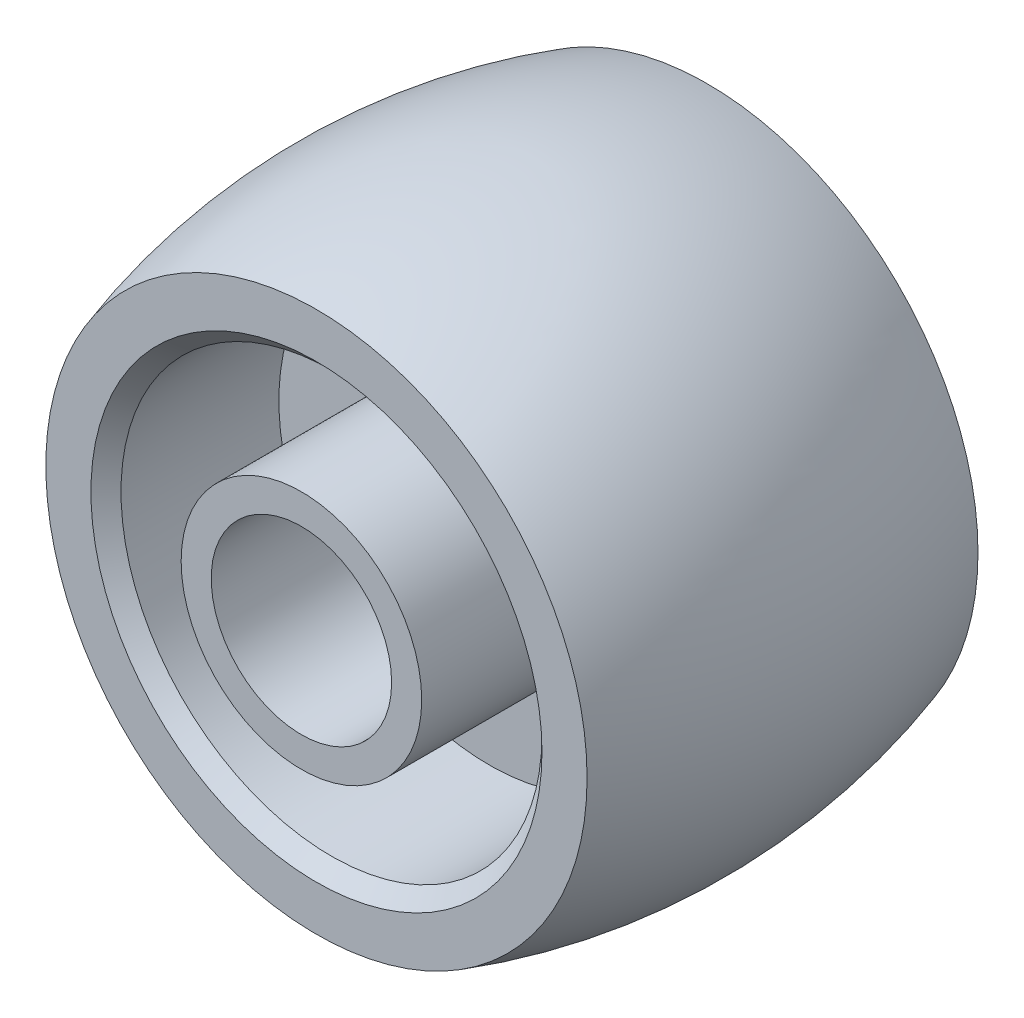
ISO-10303-21;
HEADER;
FILE_DESCRIPTION(('STEP AP214'),'2;1');
FILE_NAME('part.step','',(''),(''),'','','');
FILE_SCHEMA(('AUTOMOTIVE_DESIGN { 1 0 10303 214 1 1 1 1 }'));
ENDSEC;
DATA;
#1=APPLICATION_CONTEXT('core data for automotive mechanical design processes');
#2=APPLICATION_PROTOCOL_DEFINITION('international standard','automotive_design',2000,#1);
#3=PRODUCT_CONTEXT('',#1,'mechanical');
#4=PRODUCT('Part','Part','',(#3));
#5=PRODUCT_RELATED_PRODUCT_CATEGORY('part','',(#4));
#6=PRODUCT_DEFINITION_FORMATION('','',#4);
#7=PRODUCT_DEFINITION_CONTEXT('part definition',#1,'design');
#8=PRODUCT_DEFINITION('design','',#6,#7);
#9=PRODUCT_DEFINITION_SHAPE('','',#8);
#10=(LENGTH_UNIT() NAMED_UNIT(*) SI_UNIT(.MILLI.,.METRE.));
#11=(NAMED_UNIT(*) PLANE_ANGLE_UNIT() SI_UNIT($,.RADIAN.));
#12=(NAMED_UNIT(*) SI_UNIT($,.STERADIAN.) SOLID_ANGLE_UNIT());
#13=UNCERTAINTY_MEASURE_WITH_UNIT(LENGTH_MEASURE(1.E-05),#10,'distance_accuracy_value','');
#14=(GEOMETRIC_REPRESENTATION_CONTEXT(3) GLOBAL_UNCERTAINTY_ASSIGNED_CONTEXT((#13)) GLOBAL_UNIT_ASSIGNED_CONTEXT((#10,
#11,#12)) REPRESENTATION_CONTEXT('',''));
#15=CARTESIAN_POINT('',(0.,0.,0.));
#16=DIRECTION('',(0.,0.,1.));
#17=DIRECTION('',(1.,0.,0.));
#18=AXIS2_PLACEMENT_3D('',#15,#16,#17);
#19=CARTESIAN_POINT('',(0.,0.,6.5));
#20=DIRECTION('',(0.,0.,1.));
#21=DIRECTION('',(1.,0.,0.));
#22=AXIS2_PLACEMENT_3D('',#19,#20,#21);
#23=CONICAL_SURFACE('',#22,7.5,0.785398163397449);
#24=CARTESIAN_POINT('',(0.,0.,6.));
#25=DIRECTION('',(0.,0.,1.));
#26=DIRECTION('',(1.,0.,0.));
#27=AXIS2_PLACEMENT_3D('',#24,#25,#26);
#28=CIRCLE('',#27,7.);
#29=CARTESIAN_POINT('',(7.,0.,6.));
#30=VERTEX_POINT('',#29);
#31=EDGE_CURVE('E10',#30,#30,#28,.T.);
#32=ORIENTED_EDGE('',*,*,#31,.F.);
#33=EDGE_LOOP('',(#32));
#34=FACE_BOUND('',#33,.T.);
#35=CARTESIAN_POINT('',(0.,0.,6.5));
#36=DIRECTION('',(0.,0.,1.));
#37=DIRECTION('',(1.,0.,0.));
#38=AXIS2_PLACEMENT_3D('',#35,#36,#37);
#39=CIRCLE('',#38,7.5);
#40=CARTESIAN_POINT('',(7.5,0.,6.5));
#41=VERTEX_POINT('',#40);
#42=EDGE_CURVE('E76',#41,#41,#39,.T.);
#43=ORIENTED_EDGE('',*,*,#42,.T.);
#44=EDGE_LOOP('',(#43));
#45=FACE_BOUND('',#44,.T.);
#46=ADVANCED_FACE('F30',(#34,#45),#23,.F.);
#47=CARTESIAN_POINT('',(0.,0.,4.71471149988316));
#48=DIRECTION('',(0.,0.,1.));
#49=DIRECTION('',(1.,0.,0.));
#50=AXIS2_PLACEMENT_3D('',#47,#48,#49);
#51=CYLINDRICAL_SURFACE('',#50,7.);
#52=CARTESIAN_POINT('',(0.,0.,0.750000000000001));
#53=DIRECTION('',(0.,0.,1.));
#54=DIRECTION('',(1.,0.,0.));
#55=AXIS2_PLACEMENT_3D('',#52,#53,#54);
#56=CIRCLE('',#55,7.);
#57=CARTESIAN_POINT('',(7.,0.,0.750000000000001));
#58=VERTEX_POINT('',#57);
#59=EDGE_CURVE('E36',#58,#58,#56,.T.);
#60=ORIENTED_EDGE('',*,*,#59,.F.);
#61=EDGE_LOOP('',(#60));
#62=FACE_BOUND('',#61,.T.);
#63=ORIENTED_EDGE('',*,*,#31,.T.);
#64=EDGE_LOOP('',(#63));
#65=FACE_BOUND('',#64,.T.);
#66=ADVANCED_FACE('F149',(#62,#65),#51,.F.);
#67=CARTESIAN_POINT('',(0.,4.,0.75));
#68=DIRECTION('',(0.,0.,-1.));
#69=DIRECTION('',(-1.,0.,0.));
#70=AXIS2_PLACEMENT_3D('',#67,#68,#69);
#71=PLANE('',#70);
#72=CARTESIAN_POINT('',(0.,0.,0.75));
#73=DIRECTION('',(0.,0.,1.));
#74=DIRECTION('',(1.,0.,0.));
#75=AXIS2_PLACEMENT_3D('',#72,#73,#74);
#76=CIRCLE('',#75,4.);
#77=CARTESIAN_POINT('',(4.,0.,0.75));
#78=VERTEX_POINT('',#77);
#79=EDGE_CURVE('E40',#78,#78,#76,.T.);
#80=ORIENTED_EDGE('',*,*,#79,.F.);
#81=EDGE_LOOP('',(#80));
#82=FACE_BOUND('',#81,.T.);
#83=ORIENTED_EDGE('',*,*,#59,.T.);
#84=EDGE_LOOP('',(#83));
#85=FACE_BOUND('',#84,.T.);
#86=ADVANCED_FACE('F144',(#82,#85),#71,.F.);
#87=CARTESIAN_POINT('',(0.,0.,4.71471149988316));
#88=DIRECTION('',(0.,0.,1.));
#89=DIRECTION('',(1.,0.,0.));
#90=AXIS2_PLACEMENT_3D('',#87,#88,#89);
#91=CYLINDRICAL_SURFACE('',#90,4.);
#92=CARTESIAN_POINT('',(0.,0.,7.));
#93=DIRECTION('',(0.,0.,1.));
#94=DIRECTION('',(1.,0.,0.));
#95=AXIS2_PLACEMENT_3D('',#92,#93,#94);
#96=CIRCLE('',#95,4.);
#97=CARTESIAN_POINT('',(4.,0.,7.));
#98=VERTEX_POINT('',#97);
#99=EDGE_CURVE('E44',#98,#98,#96,.T.);
#100=ORIENTED_EDGE('',*,*,#99,.F.);
#101=EDGE_LOOP('',(#100));
#102=FACE_BOUND('',#101,.T.);
#103=ORIENTED_EDGE('',*,*,#79,.T.);
#104=EDGE_LOOP('',(#103));
#105=FACE_BOUND('',#104,.T.);
#106=ADVANCED_FACE('F138',(#102,#105),#91,.T.);
#107=CARTESIAN_POINT('',(0.,3.,7.));
#108=DIRECTION('',(0.,0.,-1.));
#109=DIRECTION('',(-1.,0.,0.));
#110=AXIS2_PLACEMENT_3D('',#107,#108,#109);
#111=PLANE('',#110);
#112=CARTESIAN_POINT('',(0.,0.,7.));
#113=DIRECTION('',(0.,0.,1.));
#114=DIRECTION('',(1.,0.,0.));
#115=AXIS2_PLACEMENT_3D('',#112,#113,#114);
#116=CIRCLE('',#115,3.);
#117=CARTESIAN_POINT('',(3.,0.,7.));
#118=VERTEX_POINT('',#117);
#119=EDGE_CURVE('E49',#118,#118,#116,.T.);
#120=ORIENTED_EDGE('',*,*,#119,.F.);
#121=EDGE_LOOP('',(#120));
#122=FACE_BOUND('',#121,.T.);
#123=ORIENTED_EDGE('',*,*,#99,.T.);
#124=EDGE_LOOP('',(#123));
#125=FACE_BOUND('',#124,.T.);
#126=ADVANCED_FACE('F132',(#122,#125),#111,.F.);
#127=CARTESIAN_POINT('',(0.,0.,4.71471149988316));
#128=DIRECTION('',(0.,0.,1.));
#129=DIRECTION('',(1.,0.,0.));
#130=AXIS2_PLACEMENT_3D('',#127,#128,#129);
#131=CYLINDRICAL_SURFACE('',#130,3.);
#132=CARTESIAN_POINT('',(0.,0.,-7.));
#133=DIRECTION('',(0.,0.,1.));
#134=DIRECTION('',(1.,0.,0.));
#135=AXIS2_PLACEMENT_3D('',#132,#133,#134);
#136=CIRCLE('',#135,3.);
#137=CARTESIAN_POINT('',(3.,0.,-7.));
#138=VERTEX_POINT('',#137);
#139=EDGE_CURVE('E52',#138,#138,#136,.T.);
#140=ORIENTED_EDGE('',*,*,#139,.F.);
#141=EDGE_LOOP('',(#140));
#142=FACE_BOUND('',#141,.T.);
#143=ORIENTED_EDGE('',*,*,#119,.T.);
#144=EDGE_LOOP('',(#143));
#145=FACE_BOUND('',#144,.T.);
#146=ADVANCED_FACE('F126',(#142,#145),#131,.F.);
#147=CARTESIAN_POINT('',(0.,3.,-7.));
#148=DIRECTION('',(0.,0.,1.));
#149=DIRECTION('',(1.,0.,0.));
#150=AXIS2_PLACEMENT_3D('',#147,#148,#149);
#151=PLANE('',#150);
#152=CARTESIAN_POINT('',(0.,0.,-7.));
#153=DIRECTION('',(0.,0.,1.));
#154=DIRECTION('',(1.,0.,0.));
#155=AXIS2_PLACEMENT_3D('',#152,#153,#154);
#156=CIRCLE('',#155,4.);
#157=CARTESIAN_POINT('',(4.,0.,-7.));
#158=VERTEX_POINT('',#157);
#159=EDGE_CURVE('E55',#158,#158,#156,.T.);
#160=ORIENTED_EDGE('',*,*,#159,.F.);
#161=EDGE_LOOP('',(#160));
#162=FACE_BOUND('',#161,.T.);
#163=ORIENTED_EDGE('',*,*,#139,.T.);
#164=EDGE_LOOP('',(#163));
#165=FACE_BOUND('',#164,.T.);
#166=ADVANCED_FACE('F120',(#162,#165),#151,.F.);
#167=CARTESIAN_POINT('',(0.,0.,4.71471149988316));
#168=DIRECTION('',(0.,0.,1.));
#169=DIRECTION('',(1.,0.,0.));
#170=AXIS2_PLACEMENT_3D('',#167,#168,#169);
#171=CYLINDRICAL_SURFACE('',#170,4.);
#172=CARTESIAN_POINT('',(0.,0.,-0.75));
#173=DIRECTION('',(0.,0.,1.));
#174=DIRECTION('',(1.,0.,0.));
#175=AXIS2_PLACEMENT_3D('',#172,#173,#174);
#176=CIRCLE('',#175,4.);
#177=CARTESIAN_POINT('',(4.,0.,-0.75));
#178=VERTEX_POINT('',#177);
#179=EDGE_CURVE('E58',#178,#178,#176,.T.);
#180=ORIENTED_EDGE('',*,*,#179,.F.);
#181=EDGE_LOOP('',(#180));
#182=FACE_BOUND('',#181,.T.);
#183=ORIENTED_EDGE('',*,*,#159,.T.);
#184=EDGE_LOOP('',(#183));
#185=FACE_BOUND('',#184,.T.);
#186=ADVANCED_FACE('F114',(#182,#185),#171,.T.);
#187=CARTESIAN_POINT('',(0.,4.,-0.75));
#188=DIRECTION('',(0.,0.,1.));
#189=DIRECTION('',(1.,0.,0.));
#190=AXIS2_PLACEMENT_3D('',#187,#188,#189);
#191=PLANE('',#190);
#192=CARTESIAN_POINT('',(0.,0.,-0.750000000000001));
#193=DIRECTION('',(0.,0.,1.));
#194=DIRECTION('',(1.,0.,0.));
#195=AXIS2_PLACEMENT_3D('',#192,#193,#194);
#196=CIRCLE('',#195,7.);
#197=CARTESIAN_POINT('',(7.,0.,-0.750000000000001));
#198=VERTEX_POINT('',#197);
#199=EDGE_CURVE('E61',#198,#198,#196,.T.);
#200=ORIENTED_EDGE('',*,*,#199,.F.);
#201=EDGE_LOOP('',(#200));
#202=FACE_BOUND('',#201,.T.);
#203=ORIENTED_EDGE('',*,*,#179,.T.);
#204=EDGE_LOOP('',(#203));
#205=FACE_BOUND('',#204,.T.);
#206=ADVANCED_FACE('F108',(#202,#205),#191,.F.);
#207=CARTESIAN_POINT('',(0.,0.,4.71471149988316));
#208=DIRECTION('',(0.,0.,1.));
#209=DIRECTION('',(1.,0.,0.));
#210=AXIS2_PLACEMENT_3D('',#207,#208,#209);
#211=CYLINDRICAL_SURFACE('',#210,7.);
#212=CARTESIAN_POINT('',(0.,0.,-6.));
#213=DIRECTION('',(0.,0.,1.));
#214=DIRECTION('',(1.,0.,0.));
#215=AXIS2_PLACEMENT_3D('',#212,#213,#214);
#216=CIRCLE('',#215,7.);
#217=CARTESIAN_POINT('',(7.,0.,-6.));
#218=VERTEX_POINT('',#217);
#219=EDGE_CURVE('E64',#218,#218,#216,.T.);
#220=ORIENTED_EDGE('',*,*,#219,.F.);
#221=EDGE_LOOP('',(#220));
#222=FACE_BOUND('',#221,.T.);
#223=ORIENTED_EDGE('',*,*,#199,.T.);
#224=EDGE_LOOP('',(#223));
#225=FACE_BOUND('',#224,.T.);
#226=ADVANCED_FACE('F102',(#222,#225),#211,.F.);
#227=CARTESIAN_POINT('',(0.,0.,-6.));
#228=DIRECTION('',(0.,0.,-1.));
#229=DIRECTION('',(-1.,0.,0.));
#230=AXIS2_PLACEMENT_3D('',#227,#228,#229);
#231=CONICAL_SURFACE('',#230,7.,0.785398163397448);
#232=CARTESIAN_POINT('',(0.,0.,-6.5));
#233=DIRECTION('',(0.,0.,1.));
#234=DIRECTION('',(1.,0.,0.));
#235=AXIS2_PLACEMENT_3D('',#232,#233,#234);
#236=CIRCLE('',#235,7.5);
#237=CARTESIAN_POINT('',(7.5,0.,-6.5));
#238=VERTEX_POINT('',#237);
#239=EDGE_CURVE('E67',#238,#238,#236,.T.);
#240=ORIENTED_EDGE('',*,*,#239,.F.);
#241=EDGE_LOOP('',(#240));
#242=FACE_BOUND('',#241,.T.);
#243=ORIENTED_EDGE('',*,*,#219,.T.);
#244=EDGE_LOOP('',(#243));
#245=FACE_BOUND('',#244,.T.);
#246=ADVANCED_FACE('F96',(#242,#245),#231,.F.);
#247=CARTESIAN_POINT('',(0.,7.5,-6.5));
#248=DIRECTION('',(0.,0.,1.));
#249=DIRECTION('',(1.,0.,0.));
#250=AXIS2_PLACEMENT_3D('',#247,#248,#249);
#251=PLANE('',#250);
#252=CARTESIAN_POINT('',(0.,0.,-6.5));
#253=DIRECTION('',(0.,0.,1.));
#254=DIRECTION('',(1.,0.,0.));
#255=AXIS2_PLACEMENT_3D('',#252,#253,#254);
#256=CIRCLE('',#255,9.);
#257=CARTESIAN_POINT('',(9.,0.,-6.5));
#258=VERTEX_POINT('',#257);
#259=EDGE_CURVE('E70',#258,#258,#256,.T.);
#260=ORIENTED_EDGE('',*,*,#259,.F.);
#261=EDGE_LOOP('',(#260));
#262=FACE_BOUND('',#261,.T.);
#263=ORIENTED_EDGE('',*,*,#239,.T.);
#264=EDGE_LOOP('',(#263));
#265=FACE_BOUND('',#264,.T.);
#266=ADVANCED_FACE('F90',(#262,#265),#251,.F.);
#267=CARTESIAN_POINT('',(0.,0.,0.));
#268=DIRECTION('',(0.,0.,1.));
#269=DIRECTION('',(1.,0.,0.));
#270=AXIS2_PLACEMENT_3D('',#267,#268,#269);
#271=DEGENERATE_TOROIDAL_SURFACE('',#270,11.625,21.625,.F.);
#272=CARTESIAN_POINT('',(0.,0.,6.5));
#273=DIRECTION('',(0.,0.,1.));
#274=DIRECTION('',(1.,0.,0.));
#275=AXIS2_PLACEMENT_3D('',#272,#273,#274);
#276=CIRCLE('',#275,9.);
#277=CARTESIAN_POINT('',(9.,0.,6.5));
#278=VERTEX_POINT('',#277);
#279=EDGE_CURVE('E73',#278,#278,#276,.T.);
#280=ORIENTED_EDGE('',*,*,#279,.F.);
#281=EDGE_LOOP('',(#280));
#282=FACE_BOUND('',#281,.T.);
#283=ORIENTED_EDGE('',*,*,#259,.T.);
#284=EDGE_LOOP('',(#283));
#285=FACE_BOUND('',#284,.T.);
#286=ADVANCED_FACE('F84',(#282,#285),#271,.F.);
#287=CARTESIAN_POINT('',(0.,7.5,6.5));
#288=DIRECTION('',(0.,0.,-1.));
#289=DIRECTION('',(-1.,0.,0.));
#290=AXIS2_PLACEMENT_3D('',#287,#288,#289);
#291=PLANE('',#290);
#292=ORIENTED_EDGE('',*,*,#42,.F.);
#293=EDGE_LOOP('',(#292));
#294=FACE_BOUND('',#293,.T.);
#295=ORIENTED_EDGE('',*,*,#279,.T.);
#296=EDGE_LOOP('',(#295));
#297=FACE_BOUND('',#296,.T.);
#298=ADVANCED_FACE('F81',(#294,#297),#291,.F.);
#299=CLOSED_SHELL('',(#46,#66,#86,#106,#126,#146,#166,#186,#206,#226,#246,#266,#286,#298));
#300=MANIFOLD_SOLID_BREP('B2',#299);
#301=ADVANCED_BREP_SHAPE_REPRESENTATION('',(#18,#300),#14);
#302=SHAPE_DEFINITION_REPRESENTATION(#9,#301);
ENDSEC;
END-ISO-10303-21;
